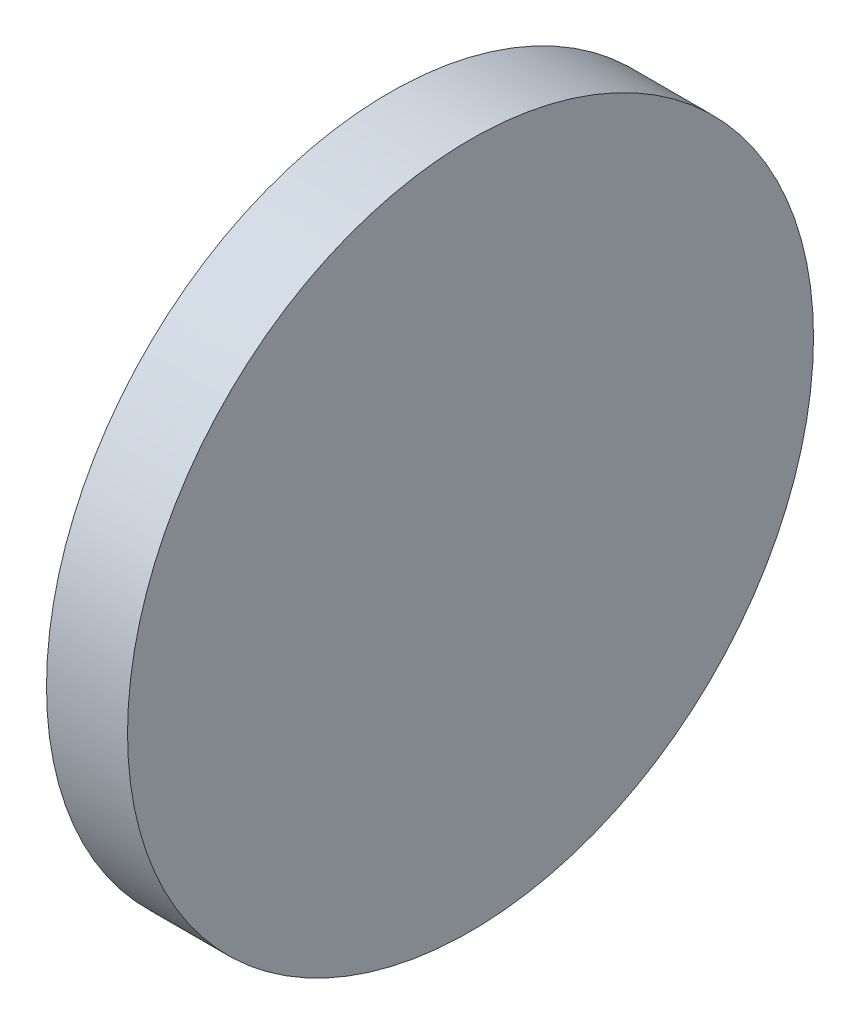
ISO-10303-21;
HEADER;
FILE_DESCRIPTION(('STEP AP214'),'2;1');
FILE_NAME('part.step','',(''),(''),'','','');
FILE_SCHEMA(('AUTOMOTIVE_DESIGN { 1 0 10303 214 1 1 1 1 }'));
ENDSEC;
DATA;
#1=APPLICATION_CONTEXT('core data for automotive mechanical design processes');
#2=APPLICATION_PROTOCOL_DEFINITION('international standard','automotive_design',2000,#1);
#3=PRODUCT_CONTEXT('',#1,'mechanical');
#4=PRODUCT('Part','Part','',(#3));
#5=PRODUCT_RELATED_PRODUCT_CATEGORY('part','',(#4));
#6=PRODUCT_DEFINITION_FORMATION('','',#4);
#7=PRODUCT_DEFINITION_CONTEXT('part definition',#1,'design');
#8=PRODUCT_DEFINITION('design','',#6,#7);
#9=PRODUCT_DEFINITION_SHAPE('','',#8);
#10=(LENGTH_UNIT() NAMED_UNIT(*) SI_UNIT(.MILLI.,.METRE.));
#11=(NAMED_UNIT(*) PLANE_ANGLE_UNIT() SI_UNIT($,.RADIAN.));
#12=(NAMED_UNIT(*) SI_UNIT($,.STERADIAN.) SOLID_ANGLE_UNIT());
#13=UNCERTAINTY_MEASURE_WITH_UNIT(LENGTH_MEASURE(1.E-05),#10,'distance_accuracy_value','');
#14=(GEOMETRIC_REPRESENTATION_CONTEXT(3) GLOBAL_UNCERTAINTY_ASSIGNED_CONTEXT((#13)) GLOBAL_UNIT_ASSIGNED_CONTEXT((#10,
#11,#12)) REPRESENTATION_CONTEXT('',''));
#15=CARTESIAN_POINT('',(0.,0.,0.));
#16=DIRECTION('',(0.,0.,1.));
#17=DIRECTION('',(1.,0.,0.));
#18=AXIS2_PLACEMENT_3D('',#15,#16,#17);
#19=CARTESIAN_POINT('',(0.,0.,0.));
#20=DIRECTION('',(-1.,0.,0.));
#21=DIRECTION('',(0.,0.,1.));
#22=AXIS2_PLACEMENT_3D('',#19,#20,#21);
#23=CYLINDRICAL_SURFACE('',#22,12.7);
#24=CARTESIAN_POINT('',(0.,0.,0.));
#25=DIRECTION('',(-1.,0.,0.));
#26=DIRECTION('',(0.,0.,1.));
#27=AXIS2_PLACEMENT_3D('',#24,#25,#26);
#28=CIRCLE('',#27,12.7);
#29=CARTESIAN_POINT('',(0.,0.,12.7));
#30=VERTEX_POINT('',#29);
#31=EDGE_CURVE('E44',#30,#30,#28,.T.);
#32=ORIENTED_EDGE('',*,*,#31,.F.);
#33=EDGE_LOOP('',(#32));
#34=FACE_BOUND('',#33,.T.);
#35=CARTESIAN_POINT('',(3.,0.,0.));
#36=DIRECTION('',(-1.,0.,0.));
#37=DIRECTION('',(0.,0.,1.));
#38=AXIS2_PLACEMENT_3D('',#35,#36,#37);
#39=CIRCLE('',#38,12.7);
#40=CARTESIAN_POINT('',(3.,0.,12.7));
#41=VERTEX_POINT('',#40);
#42=EDGE_CURVE('E10',#41,#41,#39,.T.);
#43=ORIENTED_EDGE('',*,*,#42,.T.);
#44=EDGE_LOOP('',(#43));
#45=FACE_BOUND('',#44,.T.);
#46=ADVANCED_FACE('F37',(#34,#45),#23,.T.);
#47=CARTESIAN_POINT('',(3.,12.7,0.));
#48=DIRECTION('',(-1.,0.,0.));
#49=DIRECTION('',(0.,0.,1.));
#50=AXIS2_PLACEMENT_3D('',#47,#48,#49);
#51=PLANE('',#50);
#52=ORIENTED_EDGE('',*,*,#42,.F.);
#53=EDGE_LOOP('',(#52));
#54=FACE_BOUND('',#53,.T.);
#55=ADVANCED_FACE('F54',(#54),#51,.F.);
#56=CARTESIAN_POINT('',(0.,12.7,0.));
#57=DIRECTION('',(1.,0.,0.));
#58=DIRECTION('',(0.,0.,-1.));
#59=AXIS2_PLACEMENT_3D('',#56,#57,#58);
#60=PLANE('',#59);
#61=ORIENTED_EDGE('',*,*,#31,.T.);
#62=EDGE_LOOP('',(#61));
#63=FACE_BOUND('',#62,.T.);
#64=ADVANCED_FACE('F51',(#63),#60,.F.);
#65=CLOSED_SHELL('',(#46,#55,#64));
#66=MANIFOLD_SOLID_BREP('B2',#65);
#67=ADVANCED_BREP_SHAPE_REPRESENTATION('',(#18,#66),#14);
#68=SHAPE_DEFINITION_REPRESENTATION(#9,#67);
ENDSEC;
END-ISO-10303-21;
